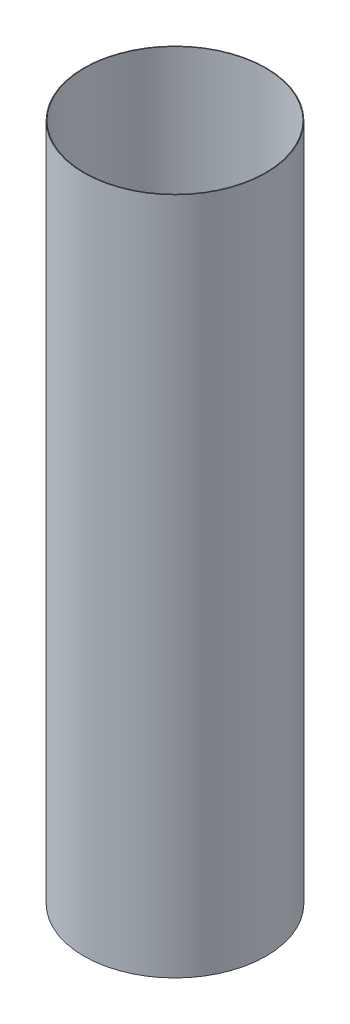
ISO-10303-21;
HEADER;
FILE_DESCRIPTION(('STEP AP214'),'2;1');
FILE_NAME('part.step','',(''),(''),'','','');
FILE_SCHEMA(('AUTOMOTIVE_DESIGN { 1 0 10303 214 1 1 1 1 }'));
ENDSEC;
DATA;
#1=APPLICATION_CONTEXT('core data for automotive mechanical design processes');
#2=APPLICATION_PROTOCOL_DEFINITION('international standard','automotive_design',2000,#1);
#3=PRODUCT_CONTEXT('',#1,'mechanical');
#4=PRODUCT('Part','Part','',(#3));
#5=PRODUCT_RELATED_PRODUCT_CATEGORY('part','',(#4));
#6=PRODUCT_DEFINITION_FORMATION('','',#4);
#7=PRODUCT_DEFINITION_CONTEXT('part definition',#1,'design');
#8=PRODUCT_DEFINITION('design','',#6,#7);
#9=PRODUCT_DEFINITION_SHAPE('','',#8);
#10=(LENGTH_UNIT() NAMED_UNIT(*) SI_UNIT(.MILLI.,.METRE.));
#11=(NAMED_UNIT(*) PLANE_ANGLE_UNIT() SI_UNIT($,.RADIAN.));
#12=(NAMED_UNIT(*) SI_UNIT($,.STERADIAN.) SOLID_ANGLE_UNIT());
#13=UNCERTAINTY_MEASURE_WITH_UNIT(LENGTH_MEASURE(1.E-05),#10,'distance_accuracy_value','');
#14=(GEOMETRIC_REPRESENTATION_CONTEXT(3) GLOBAL_UNCERTAINTY_ASSIGNED_CONTEXT((#13)) GLOBAL_UNIT_ASSIGNED_CONTEXT((#10,
#11,#12)) REPRESENTATION_CONTEXT('',''));
#15=CARTESIAN_POINT('',(0.,0.,0.));
#16=DIRECTION('',(0.,0.,1.));
#17=DIRECTION('',(1.,0.,0.));
#18=AXIS2_PLACEMENT_3D('',#15,#16,#17);
#19=CARTESIAN_POINT('',(0.,574.708528,0.));
#20=DIRECTION('',(0.,1.,0.));
#21=DIRECTION('',(0.,0.,1.));
#22=AXIS2_PLACEMENT_3D('',#19,#20,#21);
#23=PLANE('',#22);
#24=CARTESIAN_POINT('',(0.,574.708528,0.));
#25=DIRECTION('',(0.,1.,0.));
#26=DIRECTION('',(0.,0.,1.));
#27=AXIS2_PLACEMENT_3D('',#24,#25,#26);
#28=CIRCLE('',#27,77.216);
#29=CARTESIAN_POINT('',(0.,574.708528,77.216));
#30=VERTEX_POINT('',#29);
#31=EDGE_CURVE('E10',#30,#30,#28,.T.);
#32=ORIENTED_EDGE('',*,*,#31,.T.);
#33=EDGE_LOOP('',(#32));
#34=FACE_BOUND('',#33,.T.);
#35=CARTESIAN_POINT('',(0.,574.708528,0.));
#36=DIRECTION('',(0.,1.,0.));
#37=DIRECTION('',(0.,0.,1.));
#38=AXIS2_PLACEMENT_3D('',#35,#36,#37);
#39=CIRCLE('',#38,76.708);
#40=CARTESIAN_POINT('',(0.,574.708528,76.708));
#41=VERTEX_POINT('',#40);
#42=EDGE_CURVE('E44',#41,#41,#39,.T.);
#43=ORIENTED_EDGE('',*,*,#42,.F.);
#44=EDGE_LOOP('',(#43));
#45=FACE_BOUND('',#44,.T.);
#46=ADVANCED_FACE('F33',(#34,#45),#23,.T.);
#47=CARTESIAN_POINT('',(0.,0.,0.));
#48=DIRECTION('',(0.,1.,0.));
#49=DIRECTION('',(0.,0.,1.));
#50=AXIS2_PLACEMENT_3D('',#47,#48,#49);
#51=PLANE('',#50);
#52=CARTESIAN_POINT('',(0.,0.,0.));
#53=DIRECTION('',(0.,1.,0.));
#54=DIRECTION('',(0.,0.,1.));
#55=AXIS2_PLACEMENT_3D('',#52,#53,#54);
#56=CIRCLE('',#55,77.216);
#57=CARTESIAN_POINT('',(0.,0.,77.216));
#58=VERTEX_POINT('',#57);
#59=EDGE_CURVE('E37',#58,#58,#56,.T.);
#60=ORIENTED_EDGE('',*,*,#59,.F.);
#61=EDGE_LOOP('',(#60));
#62=FACE_BOUND('',#61,.T.);
#63=CARTESIAN_POINT('',(0.,0.,0.));
#64=DIRECTION('',(0.,1.,0.));
#65=DIRECTION('',(0.,0.,1.));
#66=AXIS2_PLACEMENT_3D('',#63,#64,#65);
#67=CIRCLE('',#66,76.708);
#68=CARTESIAN_POINT('',(0.,0.,76.708));
#69=VERTEX_POINT('',#68);
#70=EDGE_CURVE('E46',#69,#69,#67,.T.);
#71=ORIENTED_EDGE('',*,*,#70,.T.);
#72=EDGE_LOOP('',(#71));
#73=FACE_BOUND('',#72,.T.);
#74=ADVANCED_FACE('F56',(#62,#73),#51,.F.);
#75=CARTESIAN_POINT('',(0.,574.708528,0.));
#76=DIRECTION('',(0.,-1.,0.));
#77=DIRECTION('',(0.,0.,-1.));
#78=AXIS2_PLACEMENT_3D('',#75,#76,#77);
#79=CYLINDRICAL_SURFACE('',#78,77.216);
#80=ORIENTED_EDGE('',*,*,#31,.F.);
#81=EDGE_LOOP('',(#80));
#82=FACE_BOUND('',#81,.T.);
#83=ORIENTED_EDGE('',*,*,#59,.T.);
#84=EDGE_LOOP('',(#83));
#85=FACE_BOUND('',#84,.T.);
#86=ADVANCED_FACE('F35',(#82,#85),#79,.T.);
#87=CARTESIAN_POINT('',(0.,574.708528,0.));
#88=DIRECTION('',(0.,-1.,0.));
#89=DIRECTION('',(0.,0.,-1.));
#90=AXIS2_PLACEMENT_3D('',#87,#88,#89);
#91=CYLINDRICAL_SURFACE('',#90,76.708);
#92=ORIENTED_EDGE('',*,*,#42,.T.);
#93=EDGE_LOOP('',(#92));
#94=FACE_BOUND('',#93,.T.);
#95=ORIENTED_EDGE('',*,*,#70,.F.);
#96=EDGE_LOOP('',(#95));
#97=FACE_BOUND('',#96,.T.);
#98=ADVANCED_FACE('F52',(#94,#97),#91,.F.);
#99=CLOSED_SHELL('',(#46,#74,#86,#98));
#100=MANIFOLD_SOLID_BREP('B2',#99);
#101=ADVANCED_BREP_SHAPE_REPRESENTATION('',(#18,#100),#14);
#102=SHAPE_DEFINITION_REPRESENTATION(#9,#101);
ENDSEC;
END-ISO-10303-21;
